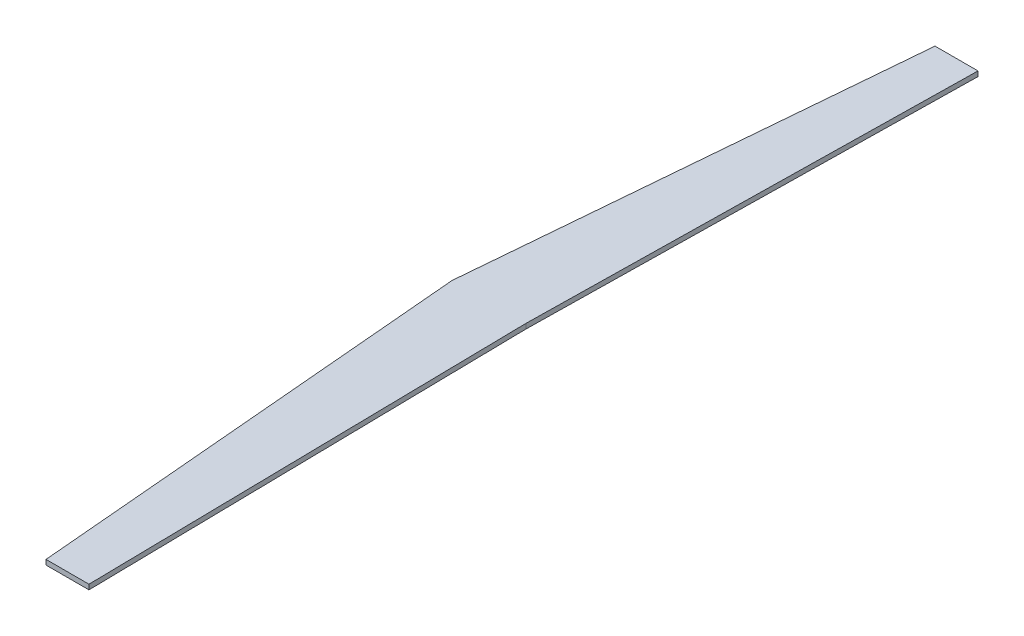
ISO-10303-21;
HEADER;
FILE_DESCRIPTION(('STEP AP214'),'2;1');
FILE_NAME('part.step','',(''),(''),'','','');
FILE_SCHEMA(('AUTOMOTIVE_DESIGN { 1 0 10303 214 1 1 1 1 }'));
ENDSEC;
DATA;
#1=APPLICATION_CONTEXT('core data for automotive mechanical design processes');
#2=APPLICATION_PROTOCOL_DEFINITION('international standard','automotive_design',2000,#1);
#3=PRODUCT_CONTEXT('',#1,'mechanical');
#4=PRODUCT('Part','Part','',(#3));
#5=PRODUCT_RELATED_PRODUCT_CATEGORY('part','',(#4));
#6=PRODUCT_DEFINITION_FORMATION('','',#4);
#7=PRODUCT_DEFINITION_CONTEXT('part definition',#1,'design');
#8=PRODUCT_DEFINITION('design','',#6,#7);
#9=PRODUCT_DEFINITION_SHAPE('','',#8);
#10=(LENGTH_UNIT() NAMED_UNIT(*) SI_UNIT(.MILLI.,.METRE.));
#11=(NAMED_UNIT(*) PLANE_ANGLE_UNIT() SI_UNIT($,.RADIAN.));
#12=(NAMED_UNIT(*) SI_UNIT($,.STERADIAN.) SOLID_ANGLE_UNIT());
#13=UNCERTAINTY_MEASURE_WITH_UNIT(LENGTH_MEASURE(1.E-05),#10,'distance_accuracy_value','');
#14=(GEOMETRIC_REPRESENTATION_CONTEXT(3) GLOBAL_UNCERTAINTY_ASSIGNED_CONTEXT((#13)) GLOBAL_UNIT_ASSIGNED_CONTEXT((#10,
#11,#12)) REPRESENTATION_CONTEXT('',''));
#15=CARTESIAN_POINT('',(0.,0.,0.));
#16=DIRECTION('',(0.,0.,1.));
#17=DIRECTION('',(1.,0.,0.));
#18=AXIS2_PLACEMENT_3D('',#15,#16,#17);
#19=CARTESIAN_POINT('',(45.,3.,0.));
#20=DIRECTION('',(-0.999861140039599,0.,-0.0166643523340721));
#21=DIRECTION('',(-0.0166643523340721,0.,0.999861140039599));
#22=AXIS2_PLACEMENT_3D('',#19,#20,#21);
#23=PLANE('',#22);
#24=DIRECTION('',(0.0166643523340721,0.,-0.999861140039599));
#25=VECTOR('',#24,1.);
#26=CARTESIAN_POINT('',(45.,0.,0.));
#27=LINE('',#26,#25);
#28=CARTESIAN_POINT('',(45.,0.,0.));
#29=VERTEX_POINT('',#28);
#30=CARTESIAN_POINT('',(49.5000000000213,0.,-270.));
#31=VERTEX_POINT('',#30);
#32=EDGE_CURVE('E128',#29,#31,#27,.T.);
#33=ORIENTED_EDGE('',*,*,#32,.T.);
#34=DIRECTION('',(0.,-1.,0.));
#35=VECTOR('',#34,1.);
#36=CARTESIAN_POINT('',(49.5000000000213,3.,-270.));
#37=LINE('',#36,#35);
#38=CARTESIAN_POINT('',(49.5000000000213,3.,-270.));
#39=VERTEX_POINT('',#38);
#40=EDGE_CURVE('E11',#39,#31,#37,.T.);
#41=ORIENTED_EDGE('',*,*,#40,.F.);
#42=DIRECTION('',(0.0166643523340721,0.,-0.999861140039599));
#43=VECTOR('',#42,1.);
#44=CARTESIAN_POINT('',(45.,3.,0.));
#45=LINE('',#44,#43);
#46=CARTESIAN_POINT('',(45.,3.,0.));
#47=VERTEX_POINT('',#46);
#48=EDGE_CURVE('E144',#47,#39,#45,.T.);
#49=ORIENTED_EDGE('',*,*,#48,.F.);
#50=DIRECTION('',(0.,-1.,0.));
#51=VECTOR('',#50,1.);
#52=CARTESIAN_POINT('',(45.,3.,0.));
#53=LINE('',#52,#51);
#54=EDGE_CURVE('E124',#47,#29,#53,.T.);
#55=ORIENTED_EDGE('',*,*,#54,.T.);
#56=EDGE_LOOP('',(#33,#41,#49,#55));
#57=FACE_BOUND('',#56,.T.);
#58=ADVANCED_FACE('F39',(#57),#23,.F.);
#59=CARTESIAN_POINT('',(49.5000000000213,3.,-270.));
#60=DIRECTION('',(0.,0.,1.));
#61=DIRECTION('',(1.,0.,0.));
#62=AXIS2_PLACEMENT_3D('',#59,#60,#61);
#63=PLANE('',#62);
#64=DIRECTION('',(-1.,0.,0.));
#65=VECTOR('',#64,1.);
#66=CARTESIAN_POINT('',(49.5000000000213,0.,-270.));
#67=LINE('',#66,#65);
#68=CARTESIAN_POINT('',(23.4000000000213,0.,-270.));
#69=VERTEX_POINT('',#68);
#70=EDGE_CURVE('E132',#31,#69,#67,.T.);
#71=ORIENTED_EDGE('',*,*,#70,.T.);
#72=DIRECTION('',(0.,-1.,0.));
#73=VECTOR('',#72,1.);
#74=CARTESIAN_POINT('',(23.4000000000213,3.,-270.));
#75=LINE('',#74,#73);
#76=CARTESIAN_POINT('',(23.4000000000213,3.,-270.));
#77=VERTEX_POINT('',#76);
#78=EDGE_CURVE('E48',#77,#69,#75,.T.);
#79=ORIENTED_EDGE('',*,*,#78,.F.);
#80=DIRECTION('',(-1.,0.,0.));
#81=VECTOR('',#80,1.);
#82=CARTESIAN_POINT('',(49.5000000000213,3.,-270.));
#83=LINE('',#82,#81);
#84=EDGE_CURVE('E93',#39,#77,#83,.T.);
#85=ORIENTED_EDGE('',*,*,#84,.F.);
#86=ORIENTED_EDGE('',*,*,#40,.T.);
#87=EDGE_LOOP('',(#71,#79,#85,#86));
#88=FACE_BOUND('',#87,.T.);
#89=ADVANCED_FACE('F172',(#88),#63,.F.);
#90=CARTESIAN_POINT('',(23.4000000000213,3.,-270.));
#91=DIRECTION('',(0.996265469182459,0.,0.0863430073292249));
#92=DIRECTION('',(0.0863430073292249,0.,-0.996265469182459));
#93=AXIS2_PLACEMENT_3D('',#90,#91,#92);
#94=PLANE('',#93);
#95=DIRECTION('',(-0.0863430073292249,0.,0.996265469182459));
#96=VECTOR('',#95,1.);
#97=CARTESIAN_POINT('',(23.4000000000213,0.,-270.));
#98=LINE('',#97,#96);
#99=CARTESIAN_POINT('',(0.,0.,0.));
#100=VERTEX_POINT('',#99);
#101=EDGE_CURVE('E135',#69,#100,#98,.T.);
#102=ORIENTED_EDGE('',*,*,#101,.T.);
#103=DIRECTION('',(0.,-1.,0.));
#104=VECTOR('',#103,1.);
#105=CARTESIAN_POINT('',(0.,3.,0.));
#106=LINE('',#105,#104);
#107=CARTESIAN_POINT('',(0.,3.,0.));
#108=VERTEX_POINT('',#107);
#109=EDGE_CURVE('E117',#108,#100,#106,.T.);
#110=ORIENTED_EDGE('',*,*,#109,.F.);
#111=DIRECTION('',(-0.0863430073292249,0.,0.996265469182459));
#112=VECTOR('',#111,1.);
#113=CARTESIAN_POINT('',(23.4000000000213,3.,-270.));
#114=LINE('',#113,#112);
#115=EDGE_CURVE('E106',#77,#108,#114,.T.);
#116=ORIENTED_EDGE('',*,*,#115,.F.);
#117=ORIENTED_EDGE('',*,*,#78,.T.);
#118=EDGE_LOOP('',(#102,#110,#116,#117));
#119=FACE_BOUND('',#118,.T.);
#120=ADVANCED_FACE('F154',(#119),#94,.F.);
#121=CARTESIAN_POINT('',(0.,3.,0.));
#122=DIRECTION('',(0.996265469182466,0.,-0.086343007329147));
#123=DIRECTION('',(-0.086343007329147,0.,-0.996265469182466));
#124=AXIS2_PLACEMENT_3D('',#121,#122,#123);
#125=PLANE('',#124);
#126=DIRECTION('',(0.086343007329147,0.,0.996265469182466));
#127=VECTOR('',#126,1.);
#128=CARTESIAN_POINT('',(0.,0.,0.));
#129=LINE('',#128,#127);
#130=CARTESIAN_POINT('',(23.4,0.,270.));
#131=VERTEX_POINT('',#130);
#132=EDGE_CURVE('E115',#100,#131,#129,.T.);
#133=ORIENTED_EDGE('',*,*,#132,.T.);
#134=DIRECTION('',(0.,-1.,0.));
#135=VECTOR('',#134,1.);
#136=CARTESIAN_POINT('',(23.4,3.,270.));
#137=LINE('',#136,#135);
#138=CARTESIAN_POINT('',(23.4,3.,270.));
#139=VERTEX_POINT('',#138);
#140=EDGE_CURVE('E112',#139,#131,#137,.T.);
#141=ORIENTED_EDGE('',*,*,#140,.F.);
#142=DIRECTION('',(0.086343007329147,0.,0.996265469182466));
#143=VECTOR('',#142,1.);
#144=CARTESIAN_POINT('',(0.,3.,0.));
#145=LINE('',#144,#143);
#146=EDGE_CURVE('E100',#108,#139,#145,.T.);
#147=ORIENTED_EDGE('',*,*,#146,.F.);
#148=ORIENTED_EDGE('',*,*,#109,.T.);
#149=EDGE_LOOP('',(#133,#141,#147,#148));
#150=FACE_BOUND('',#149,.T.);
#151=ADVANCED_FACE('F113',(#150),#125,.F.);
#152=CARTESIAN_POINT('',(23.4,3.,270.));
#153=DIRECTION('',(0.,0.,-1.));
#154=DIRECTION('',(-1.,0.,0.));
#155=AXIS2_PLACEMENT_3D('',#152,#153,#154);
#156=PLANE('',#155);
#157=DIRECTION('',(1.,0.,0.));
#158=VECTOR('',#157,1.);
#159=CARTESIAN_POINT('',(23.4,0.,270.));
#160=LINE('',#159,#158);
#161=CARTESIAN_POINT('',(49.5,0.,270.));
#162=VERTEX_POINT('',#161);
#163=EDGE_CURVE('E79',#131,#162,#160,.T.);
#164=ORIENTED_EDGE('',*,*,#163,.T.);
#165=DIRECTION('',(0.,-1.,0.));
#166=VECTOR('',#165,1.);
#167=CARTESIAN_POINT('',(49.5,3.,270.));
#168=LINE('',#167,#166);
#169=CARTESIAN_POINT('',(49.5,3.,270.));
#170=VERTEX_POINT('',#169);
#171=EDGE_CURVE('E118',#170,#162,#168,.T.);
#172=ORIENTED_EDGE('',*,*,#171,.F.);
#173=DIRECTION('',(1.,0.,0.));
#174=VECTOR('',#173,1.);
#175=CARTESIAN_POINT('',(23.4,3.,270.));
#176=LINE('',#175,#174);
#177=EDGE_CURVE('E104',#139,#170,#176,.T.);
#178=ORIENTED_EDGE('',*,*,#177,.F.);
#179=ORIENTED_EDGE('',*,*,#140,.T.);
#180=EDGE_LOOP('',(#164,#172,#178,#179));
#181=FACE_BOUND('',#180,.T.);
#182=ADVANCED_FACE('F120',(#181),#156,.F.);
#183=CARTESIAN_POINT('',(49.5,3.,270.));
#184=DIRECTION('',(-0.9998611400396,0.,0.0166643523339933));
#185=DIRECTION('',(0.0166643523339933,0.,0.9998611400396));
#186=AXIS2_PLACEMENT_3D('',#183,#184,#185);
#187=PLANE('',#186);
#188=DIRECTION('',(-0.0166643523339933,0.,-0.9998611400396));
#189=VECTOR('',#188,1.);
#190=CARTESIAN_POINT('',(49.5,0.,270.));
#191=LINE('',#190,#189);
#192=EDGE_CURVE('E85',#162,#29,#191,.T.);
#193=ORIENTED_EDGE('',*,*,#192,.T.);
#194=ORIENTED_EDGE('',*,*,#54,.F.);
#195=DIRECTION('',(-0.0166643523339933,0.,-0.9998611400396));
#196=VECTOR('',#195,1.);
#197=CARTESIAN_POINT('',(49.5,3.,270.));
#198=LINE('',#197,#196);
#199=EDGE_CURVE('E56',#170,#47,#198,.T.);
#200=ORIENTED_EDGE('',*,*,#199,.F.);
#201=ORIENTED_EDGE('',*,*,#171,.T.);
#202=EDGE_LOOP('',(#193,#194,#200,#201));
#203=FACE_BOUND('',#202,.T.);
#204=ADVANCED_FACE('F161',(#203),#187,.F.);
#205=CARTESIAN_POINT('',(0.,3.,0.));
#206=DIRECTION('',(0.,1.,0.));
#207=DIRECTION('',(0.,0.,1.));
#208=AXIS2_PLACEMENT_3D('',#205,#206,#207);
#209=PLANE('',#208);
#210=ORIENTED_EDGE('',*,*,#48,.T.);
#211=ORIENTED_EDGE('',*,*,#84,.T.);
#212=ORIENTED_EDGE('',*,*,#115,.T.);
#213=ORIENTED_EDGE('',*,*,#146,.T.);
#214=ORIENTED_EDGE('',*,*,#177,.T.);
#215=ORIENTED_EDGE('',*,*,#199,.T.);
#216=EDGE_LOOP('',(#210,#211,#212,#213,#214,#215));
#217=FACE_BOUND('',#216,.T.);
#218=ADVANCED_FACE('F102',(#217),#209,.T.);
#219=CARTESIAN_POINT('',(0.,0.,0.));
#220=DIRECTION('',(0.,1.,0.));
#221=DIRECTION('',(0.,0.,1.));
#222=AXIS2_PLACEMENT_3D('',#219,#220,#221);
#223=PLANE('',#222);
#224=ORIENTED_EDGE('',*,*,#32,.F.);
#225=ORIENTED_EDGE('',*,*,#192,.F.);
#226=ORIENTED_EDGE('',*,*,#163,.F.);
#227=ORIENTED_EDGE('',*,*,#132,.F.);
#228=ORIENTED_EDGE('',*,*,#101,.F.);
#229=ORIENTED_EDGE('',*,*,#70,.F.);
#230=EDGE_LOOP('',(#224,#225,#226,#227,#228,#229));
#231=FACE_BOUND('',#230,.T.);
#232=ADVANCED_FACE('F157',(#231),#223,.F.);
#233=CLOSED_SHELL('',(#58,#89,#120,#151,#182,#204,#218,#232));
#234=MANIFOLD_SOLID_BREP('B2',#233);
#235=ADVANCED_BREP_SHAPE_REPRESENTATION('',(#18,#234),#14);
#236=SHAPE_DEFINITION_REPRESENTATION(#9,#235);
ENDSEC;
END-ISO-10303-21;
